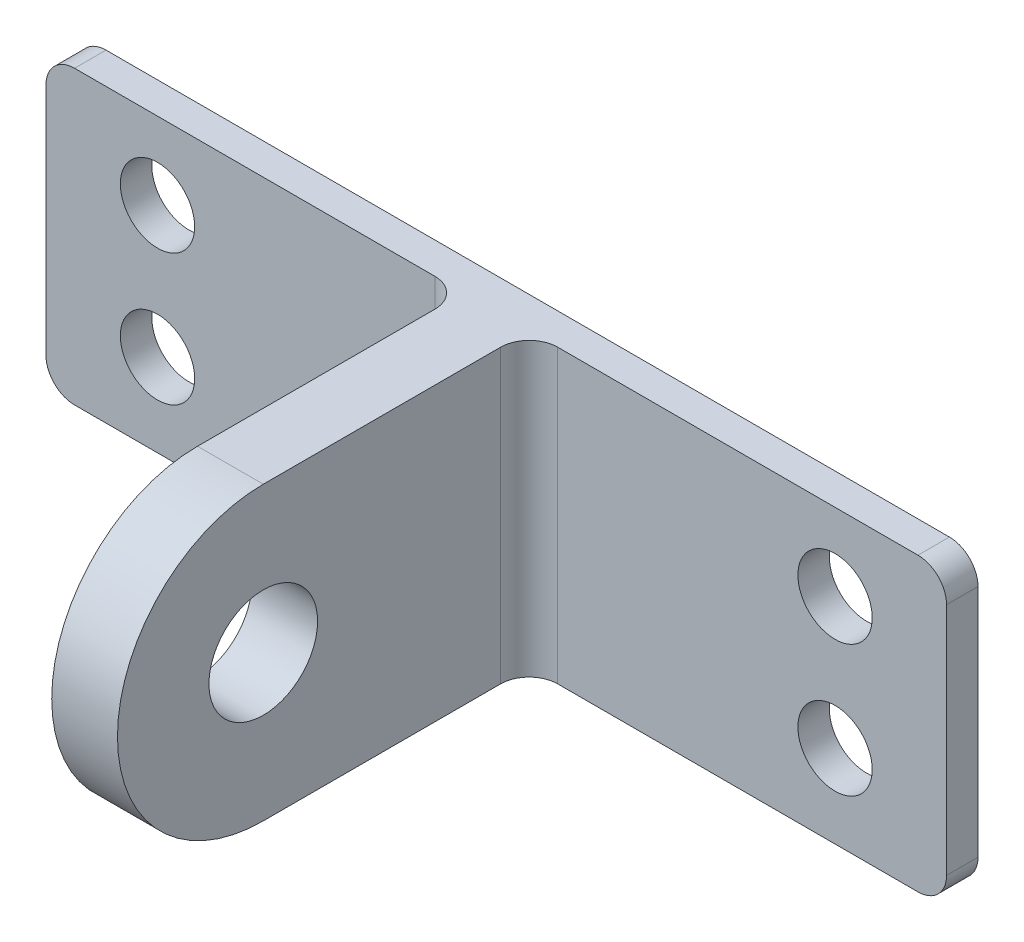
ISO-10303-21;
HEADER;
FILE_DESCRIPTION(('STEP AP214'),'2;1');
FILE_NAME('part.step','',(''),(''),'','','');
FILE_SCHEMA(('AUTOMOTIVE_DESIGN { 1 0 10303 214 1 1 1 1 }'));
ENDSEC;
DATA;
#1=APPLICATION_CONTEXT('core data for automotive mechanical design processes');
#2=APPLICATION_PROTOCOL_DEFINITION('international standard','automotive_design',2000,#1);
#3=PRODUCT_CONTEXT('',#1,'mechanical');
#4=PRODUCT('Part','Part','',(#3));
#5=PRODUCT_RELATED_PRODUCT_CATEGORY('part','',(#4));
#6=PRODUCT_DEFINITION_FORMATION('','',#4);
#7=PRODUCT_DEFINITION_CONTEXT('part definition',#1,'design');
#8=PRODUCT_DEFINITION('design','',#6,#7);
#9=PRODUCT_DEFINITION_SHAPE('','',#8);
#10=(LENGTH_UNIT() NAMED_UNIT(*) SI_UNIT(.MILLI.,.METRE.));
#11=(NAMED_UNIT(*) PLANE_ANGLE_UNIT() SI_UNIT($,.RADIAN.));
#12=(NAMED_UNIT(*) SI_UNIT($,.STERADIAN.) SOLID_ANGLE_UNIT());
#13=UNCERTAINTY_MEASURE_WITH_UNIT(LENGTH_MEASURE(1.E-05),#10,'distance_accuracy_value','');
#14=(GEOMETRIC_REPRESENTATION_CONTEXT(3) GLOBAL_UNCERTAINTY_ASSIGNED_CONTEXT((#13)) GLOBAL_UNIT_ASSIGNED_CONTEXT((#10,
#11,#12)) REPRESENTATION_CONTEXT('',''));
#15=CARTESIAN_POINT('',(0.,0.,0.));
#16=DIRECTION('',(0.,0.,1.));
#17=DIRECTION('',(1.,0.,0.));
#18=AXIS2_PLACEMENT_3D('',#15,#16,#17);
#19=CARTESIAN_POINT('',(0.,0.571428571428572,2.794));
#20=DIRECTION('',(0.,1.,0.));
#21=DIRECTION('',(0.,0.,1.));
#22=AXIS2_PLACEMENT_3D('',#19,#20,#21);
#23=PLANE('',#22);
#24=DIRECTION('',(0.,0.,-1.));
#25=VECTOR('',#24,1.);
#26=CARTESIAN_POINT('',(36.135948051948,0.571428571428572,39.624));
#27=LINE('',#26,#25);
#28=CARTESIAN_POINT('',(36.135948051948,0.571428571428572,26.416));
#29=VERTEX_POINT('',#28);
#30=CARTESIAN_POINT('',(36.135948051948,0.571428571428572,5.334));
#31=VERTEX_POINT('',#30);
#32=EDGE_CURVE('E147',#29,#31,#27,.T.);
#33=ORIENTED_EDGE('',*,*,#32,.F.);
#34=DIRECTION('',(1.,0.,0.));
#35=VECTOR('',#34,1.);
#36=CARTESIAN_POINT('',(2.35394805194805,0.571428571428572,26.416));
#37=LINE('',#36,#35);
#38=CARTESIAN_POINT('',(41.9779480519481,0.571428571428572,26.416));
#39=VERTEX_POINT('',#38);
#40=EDGE_CURVE('E137',#29,#39,#37,.T.);
#41=ORIENTED_EDGE('',*,*,#40,.T.);
#42=DIRECTION('',(0.,0.,-1.));
#43=VECTOR('',#42,1.);
#44=CARTESIAN_POINT('',(41.9779480519481,0.571428571428572,39.624));
#45=LINE('',#44,#43);
#46=CARTESIAN_POINT('',(41.9779480519481,0.571428571428572,5.334));
#47=VERTEX_POINT('',#46);
#48=EDGE_CURVE('E144',#39,#47,#45,.T.);
#49=ORIENTED_EDGE('',*,*,#48,.T.);
#50=CARTESIAN_POINT('',(44.5179480519481,0.571428571428572,5.334));
#51=DIRECTION('',(0.,1.,0.));
#52=DIRECTION('',(0.,0.,1.));
#53=AXIS2_PLACEMENT_3D('',#50,#51,#52);
#54=CIRCLE('',#53,2.54);
#55=CARTESIAN_POINT('',(44.5179480519481,0.571428571428572,2.794));
#56=VERTEX_POINT('',#55);
#57=EDGE_CURVE('E11',#47,#56,#54,.F.);
#58=ORIENTED_EDGE('',*,*,#57,.T.);
#59=DIRECTION('',(1.,0.,0.));
#60=VECTOR('',#59,1.);
#61=CARTESIAN_POINT('',(0.,0.571428571428572,2.794));
#62=LINE('',#61,#60);
#63=CARTESIAN_POINT('',(76.521948051948,0.571428571428572,2.794));
#64=VERTEX_POINT('',#63);
#65=EDGE_CURVE('E284',#56,#64,#62,.T.);
#66=ORIENTED_EDGE('',*,*,#65,.T.);
#67=DIRECTION('',(0.,0.,-1.));
#68=VECTOR('',#67,1.);
#69=CARTESIAN_POINT('',(76.521948051948,0.571428571428572,0.));
#70=LINE('',#69,#68);
#71=CARTESIAN_POINT('',(76.521948051948,0.571428571428572,0.));
#72=VERTEX_POINT('',#71);
#73=EDGE_CURVE('E187',#64,#72,#70,.T.);
#74=ORIENTED_EDGE('',*,*,#73,.T.);
#75=DIRECTION('',(1.,0.,0.));
#76=VECTOR('',#75,1.);
#77=CARTESIAN_POINT('',(0.,0.571428571428572,0.));
#78=LINE('',#77,#76);
#79=CARTESIAN_POINT('',(1.59194805194805,0.571428571428572,0.));
#80=VERTEX_POINT('',#79);
#81=EDGE_CURVE('E150',#80,#72,#78,.T.);
#82=ORIENTED_EDGE('',*,*,#81,.F.);
#83=DIRECTION('',(0.,0.,-1.));
#84=VECTOR('',#83,1.);
#85=CARTESIAN_POINT('',(1.59194805194805,0.571428571428572,2.794));
#86=LINE('',#85,#84);
#87=CARTESIAN_POINT('',(1.59194805194805,0.571428571428572,2.794));
#88=VERTEX_POINT('',#87);
#89=EDGE_CURVE('E174',#80,#88,#86,.F.);
#90=ORIENTED_EDGE('',*,*,#89,.T.);
#91=DIRECTION('',(1.,0.,0.));
#92=VECTOR('',#91,1.);
#93=CARTESIAN_POINT('',(0.,0.571428571428572,2.794));
#94=LINE('',#93,#92);
#95=CARTESIAN_POINT('',(33.595948051948,0.571428571428572,2.794));
#96=VERTEX_POINT('',#95);
#97=EDGE_CURVE('E159',#88,#96,#94,.T.);
#98=ORIENTED_EDGE('',*,*,#97,.T.);
#99=CARTESIAN_POINT('',(33.595948051948,0.571428571428572,5.334));
#100=DIRECTION('',(0.,1.,0.));
#101=DIRECTION('',(0.,0.,1.));
#102=AXIS2_PLACEMENT_3D('',#99,#100,#101);
#103=CIRCLE('',#102,2.54);
#104=EDGE_CURVE('E234',#96,#31,#103,.F.);
#105=ORIENTED_EDGE('',*,*,#104,.T.);
#106=EDGE_LOOP('',(#33,#41,#49,#58,#66,#74,#82,#90,#98,#105));
#107=FACE_BOUND('',#106,.T.);
#108=ADVANCED_FACE('F34',(#107),#23,.T.);
#109=CARTESIAN_POINT('',(0.,-25.3365714285714,2.794));
#110=DIRECTION('',(0.,1.,0.));
#111=DIRECTION('',(0.,0.,1.));
#112=AXIS2_PLACEMENT_3D('',#109,#110,#111);
#113=PLANE('',#112);
#114=DIRECTION('',(1.,0.,0.));
#115=VECTOR('',#114,1.);
#116=CARTESIAN_POINT('',(2.35394805194805,-25.3365714285714,26.416));
#117=LINE('',#116,#115);
#118=CARTESIAN_POINT('',(36.135948051948,-25.3365714285714,26.416));
#119=VERTEX_POINT('',#118);
#120=CARTESIAN_POINT('',(41.9779480519481,-25.3365714285714,26.416));
#121=VERTEX_POINT('',#120);
#122=EDGE_CURVE('E140',#119,#121,#117,.T.);
#123=ORIENTED_EDGE('',*,*,#122,.F.);
#124=DIRECTION('',(0.,0.,-1.));
#125=VECTOR('',#124,1.);
#126=CARTESIAN_POINT('',(36.135948051948,-25.3365714285714,39.624));
#127=LINE('',#126,#125);
#128=CARTESIAN_POINT('',(36.135948051948,-25.3365714285714,5.334));
#129=VERTEX_POINT('',#128);
#130=EDGE_CURVE('E155',#119,#129,#127,.T.);
#131=ORIENTED_EDGE('',*,*,#130,.T.);
#132=CARTESIAN_POINT('',(33.595948051948,-25.3365714285714,5.334));
#133=DIRECTION('',(0.,1.,0.));
#134=DIRECTION('',(0.,0.,1.));
#135=AXIS2_PLACEMENT_3D('',#132,#133,#134);
#136=CIRCLE('',#135,2.54);
#137=CARTESIAN_POINT('',(33.595948051948,-25.3365714285714,2.794));
#138=VERTEX_POINT('',#137);
#139=EDGE_CURVE('E232',#129,#138,#136,.T.);
#140=ORIENTED_EDGE('',*,*,#139,.T.);
#141=DIRECTION('',(1.,0.,0.));
#142=VECTOR('',#141,1.);
#143=CARTESIAN_POINT('',(0.,-25.3365714285714,2.794));
#144=LINE('',#143,#142);
#145=CARTESIAN_POINT('',(1.59194805194805,-25.3365714285714,2.794));
#146=VERTEX_POINT('',#145);
#147=EDGE_CURVE('E166',#146,#138,#144,.T.);
#148=ORIENTED_EDGE('',*,*,#147,.F.);
#149=DIRECTION('',(0.,0.,-1.));
#150=VECTOR('',#149,1.);
#151=CARTESIAN_POINT('',(1.59194805194805,-25.3365714285714,0.));
#152=LINE('',#151,#150);
#153=CARTESIAN_POINT('',(1.59194805194805,-25.3365714285714,0.));
#154=VERTEX_POINT('',#153);
#155=EDGE_CURVE('E208',#146,#154,#152,.T.);
#156=ORIENTED_EDGE('',*,*,#155,.T.);
#157=DIRECTION('',(1.,0.,0.));
#158=VECTOR('',#157,1.);
#159=CARTESIAN_POINT('',(0.,-25.3365714285714,0.));
#160=LINE('',#159,#158);
#161=CARTESIAN_POINT('',(76.521948051948,-25.3365714285714,0.));
#162=VERTEX_POINT('',#161);
#163=EDGE_CURVE('E178',#154,#162,#160,.T.);
#164=ORIENTED_EDGE('',*,*,#163,.T.);
#165=DIRECTION('',(0.,0.,-1.));
#166=VECTOR('',#165,1.);
#167=CARTESIAN_POINT('',(76.521948051948,-25.3365714285714,2.794));
#168=LINE('',#167,#166);
#169=CARTESIAN_POINT('',(76.521948051948,-25.3365714285714,2.794));
#170=VERTEX_POINT('',#169);
#171=EDGE_CURVE('E211',#162,#170,#168,.F.);
#172=ORIENTED_EDGE('',*,*,#171,.T.);
#173=DIRECTION('',(1.,0.,0.));
#174=VECTOR('',#173,1.);
#175=CARTESIAN_POINT('',(0.,-25.3365714285714,2.794));
#176=LINE('',#175,#174);
#177=CARTESIAN_POINT('',(44.5179480519481,-25.3365714285714,2.794));
#178=VERTEX_POINT('',#177);
#179=EDGE_CURVE('E279',#178,#170,#176,.T.);
#180=ORIENTED_EDGE('',*,*,#179,.F.);
#181=CARTESIAN_POINT('',(44.5179480519481,-25.3365714285714,5.334));
#182=DIRECTION('',(0.,1.,0.));
#183=DIRECTION('',(0.,0.,1.));
#184=AXIS2_PLACEMENT_3D('',#181,#182,#183);
#185=CIRCLE('',#184,2.54);
#186=CARTESIAN_POINT('',(41.9779480519481,-25.3365714285714,5.334));
#187=VERTEX_POINT('',#186);
#188=EDGE_CURVE('E42',#178,#187,#185,.T.);
#189=ORIENTED_EDGE('',*,*,#188,.T.);
#190=DIRECTION('',(0.,0.,-1.));
#191=VECTOR('',#190,1.);
#192=CARTESIAN_POINT('',(41.9779480519481,-25.3365714285714,39.624));
#193=LINE('',#192,#191);
#194=EDGE_CURVE('E282',#121,#187,#193,.T.);
#195=ORIENTED_EDGE('',*,*,#194,.F.);
#196=EDGE_LOOP('',(#123,#131,#140,#148,#156,#164,#172,#180,#189,#195));
#197=FACE_BOUND('',#196,.T.);
#198=ADVANCED_FACE('F247',(#197),#113,.F.);
#199=CARTESIAN_POINT('',(36.135948051948,0.,39.624));
#200=DIRECTION('',(1.,0.,0.));
#201=DIRECTION('',(0.,0.,-1.));
#202=AXIS2_PLACEMENT_3D('',#199,#200,#201);
#203=PLANE('',#202);
#204=CARTESIAN_POINT('',(36.135948051948,-12.3825714285714,26.416));
#205=DIRECTION('',(1.,0.,0.));
#206=DIRECTION('',(0.,0.,-1.));
#207=AXIS2_PLACEMENT_3D('',#204,#205,#206);
#208=CIRCLE('',#207,4.826);
#209=CARTESIAN_POINT('',(36.135948051948,-12.3825714285714,21.59));
#210=VERTEX_POINT('',#209);
#211=EDGE_CURVE('E291',#210,#210,#208,.T.);
#212=ORIENTED_EDGE('',*,*,#211,.T.);
#213=EDGE_LOOP('',(#212));
#214=FACE_BOUND('',#213,.T.);
#215=ORIENTED_EDGE('',*,*,#32,.T.);
#216=DIRECTION('',(0.,-1.,0.));
#217=VECTOR('',#216,1.);
#218=CARTESIAN_POINT('',(36.135948051948,0.,5.334));
#219=LINE('',#218,#217);
#220=EDGE_CURVE('E223',#31,#129,#219,.T.);
#221=ORIENTED_EDGE('',*,*,#220,.T.);
#222=ORIENTED_EDGE('',*,*,#130,.F.);
#223=CARTESIAN_POINT('',(36.135948051948,-12.3825714285714,26.416));
#224=DIRECTION('',(1.,0.,0.));
#225=DIRECTION('',(0.,0.,-1.));
#226=AXIS2_PLACEMENT_3D('',#223,#224,#225);
#227=CIRCLE('',#226,12.954);
#228=EDGE_CURVE('E244',#29,#119,#227,.T.);
#229=ORIENTED_EDGE('',*,*,#228,.F.);
#230=EDGE_LOOP('',(#215,#221,#222,#229));
#231=FACE_BOUND('',#230,.T.);
#232=ADVANCED_FACE('F241',(#214,#231),#203,.F.);
#233=CARTESIAN_POINT('',(41.9779480519481,0.,39.624));
#234=DIRECTION('',(1.,0.,0.));
#235=DIRECTION('',(0.,0.,-1.));
#236=AXIS2_PLACEMENT_3D('',#233,#234,#235);
#237=PLANE('',#236);
#238=CARTESIAN_POINT('',(41.9779480519481,-12.3825714285714,26.416));
#239=DIRECTION('',(1.,0.,0.));
#240=DIRECTION('',(0.,0.,-1.));
#241=AXIS2_PLACEMENT_3D('',#238,#239,#240);
#242=CIRCLE('',#241,4.826);
#243=CARTESIAN_POINT('',(41.9779480519481,-12.3825714285714,21.59));
#244=VERTEX_POINT('',#243);
#245=EDGE_CURVE('E308',#244,#244,#242,.T.);
#246=ORIENTED_EDGE('',*,*,#245,.F.);
#247=EDGE_LOOP('',(#246));
#248=FACE_BOUND('',#247,.T.);
#249=ORIENTED_EDGE('',*,*,#194,.T.);
#250=DIRECTION('',(0.,-1.,0.));
#251=VECTOR('',#250,1.);
#252=CARTESIAN_POINT('',(41.9779480519481,0.571428571428572,5.334));
#253=LINE('',#252,#251);
#254=EDGE_CURVE('E55',#187,#47,#253,.F.);
#255=ORIENTED_EDGE('',*,*,#254,.T.);
#256=ORIENTED_EDGE('',*,*,#48,.F.);
#257=CARTESIAN_POINT('',(41.9779480519481,-12.3825714285714,26.416));
#258=DIRECTION('',(1.,0.,0.));
#259=DIRECTION('',(0.,0.,-1.));
#260=AXIS2_PLACEMENT_3D('',#257,#258,#259);
#261=CIRCLE('',#260,12.954);
#262=EDGE_CURVE('E134',#39,#121,#261,.T.);
#263=ORIENTED_EDGE('',*,*,#262,.T.);
#264=EDGE_LOOP('',(#249,#255,#256,#263));
#265=FACE_BOUND('',#264,.T.);
#266=ADVANCED_FACE('F149',(#248,#265),#237,.T.);
#267=CARTESIAN_POINT('',(-0.948051948051948,0.,2.794));
#268=DIRECTION('',(-1.,0.,0.));
#269=DIRECTION('',(0.,-1.,0.));
#270=AXIS2_PLACEMENT_3D('',#267,#268,#269);
#271=PLANE('',#270);
#272=DIRECTION('',(0.,1.,0.));
#273=VECTOR('',#272,1.);
#274=CARTESIAN_POINT('',(-0.948051948051948,0.,0.));
#275=LINE('',#274,#273);
#276=CARTESIAN_POINT('',(-0.948051948051945,-22.7965714285714,0.));
#277=VERTEX_POINT('',#276);
#278=CARTESIAN_POINT('',(-0.948051948051947,-1.96857142857143,0.));
#279=VERTEX_POINT('',#278);
#280=EDGE_CURVE('E153',#277,#279,#275,.T.);
#281=ORIENTED_EDGE('',*,*,#280,.F.);
#282=DIRECTION('',(0.,0.,-1.));
#283=VECTOR('',#282,1.);
#284=CARTESIAN_POINT('',(-0.948051948051945,-22.7965714285714,2.794));
#285=LINE('',#284,#283);
#286=CARTESIAN_POINT('',(-0.948051948051945,-22.7965714285714,2.794));
#287=VERTEX_POINT('',#286);
#288=EDGE_CURVE('E217',#277,#287,#285,.F.);
#289=ORIENTED_EDGE('',*,*,#288,.T.);
#290=DIRECTION('',(0.,1.,0.));
#291=VECTOR('',#290,1.);
#292=CARTESIAN_POINT('',(-0.948051948051948,0.,2.794));
#293=LINE('',#292,#291);
#294=CARTESIAN_POINT('',(-0.948051948051947,-1.96857142857143,2.794));
#295=VERTEX_POINT('',#294);
#296=EDGE_CURVE('E162',#287,#295,#293,.T.);
#297=ORIENTED_EDGE('',*,*,#296,.T.);
#298=DIRECTION('',(0.,0.,-1.));
#299=VECTOR('',#298,1.);
#300=CARTESIAN_POINT('',(-0.948051948051947,-1.96857142857143,2.794));
#301=LINE('',#300,#299);
#302=EDGE_CURVE('E214',#295,#279,#301,.T.);
#303=ORIENTED_EDGE('',*,*,#302,.T.);
#304=EDGE_LOOP('',(#281,#289,#297,#303));
#305=FACE_BOUND('',#304,.T.);
#306=ADVANCED_FACE('F318',(#305),#271,.T.);
#307=CARTESIAN_POINT('',(8.95794805194805,-6.28657142857143,2.794));
#308=DIRECTION('',(0.,0.,-1.));
#309=DIRECTION('',(-1.,0.,0.));
#310=AXIS2_PLACEMENT_3D('',#307,#308,#309);
#311=CYLINDRICAL_SURFACE('',#310,3.302);
#312=CARTESIAN_POINT('',(8.95794805194805,-6.28657142857143,2.794));
#313=DIRECTION('',(0.,0.,1.));
#314=DIRECTION('',(1.,0.,0.));
#315=AXIS2_PLACEMENT_3D('',#312,#313,#314);
#316=CIRCLE('',#315,3.302);
#317=CARTESIAN_POINT('',(12.2599480519481,-6.28657142857143,2.794));
#318=VERTEX_POINT('',#317);
#319=EDGE_CURVE('E169',#318,#318,#316,.T.);
#320=ORIENTED_EDGE('',*,*,#319,.T.);
#321=EDGE_LOOP('',(#320));
#322=FACE_BOUND('',#321,.T.);
#323=CARTESIAN_POINT('',(8.95794805194805,-6.28657142857143,0.));
#324=DIRECTION('',(0.,0.,1.));
#325=DIRECTION('',(1.,0.,0.));
#326=AXIS2_PLACEMENT_3D('',#323,#324,#325);
#327=CIRCLE('',#326,3.302);
#328=CARTESIAN_POINT('',(12.2599480519481,-6.28657142857143,0.));
#329=VERTEX_POINT('',#328);
#330=EDGE_CURVE('E181',#329,#329,#327,.T.);
#331=ORIENTED_EDGE('',*,*,#330,.F.);
#332=EDGE_LOOP('',(#331));
#333=FACE_BOUND('',#332,.T.);
#334=ADVANCED_FACE('F324',(#322,#333),#311,.F.);
#335=CARTESIAN_POINT('',(8.95794805194805,-17.9705714285714,2.794));
#336=DIRECTION('',(0.,0.,-1.));
#337=DIRECTION('',(-1.,0.,0.));
#338=AXIS2_PLACEMENT_3D('',#335,#336,#337);
#339=CYLINDRICAL_SURFACE('',#338,3.302);
#340=CARTESIAN_POINT('',(8.95794805194805,-17.9705714285714,2.794));
#341=DIRECTION('',(0.,0.,1.));
#342=DIRECTION('',(1.,0.,0.));
#343=AXIS2_PLACEMENT_3D('',#340,#341,#342);
#344=CIRCLE('',#343,3.302);
#345=CARTESIAN_POINT('',(12.2599480519481,-17.9705714285714,2.794));
#346=VERTEX_POINT('',#345);
#347=EDGE_CURVE('E172',#346,#346,#344,.F.);
#348=ORIENTED_EDGE('',*,*,#347,.F.);
#349=EDGE_LOOP('',(#348));
#350=FACE_BOUND('',#349,.T.);
#351=CARTESIAN_POINT('',(8.95794805194805,-17.9705714285714,0.));
#352=DIRECTION('',(0.,0.,1.));
#353=DIRECTION('',(1.,0.,0.));
#354=AXIS2_PLACEMENT_3D('',#351,#352,#353);
#355=CIRCLE('',#354,3.302);
#356=CARTESIAN_POINT('',(12.2599480519481,-17.9705714285714,0.));
#357=VERTEX_POINT('',#356);
#358=EDGE_CURVE('E163',#357,#357,#355,.F.);
#359=ORIENTED_EDGE('',*,*,#358,.T.);
#360=EDGE_LOOP('',(#359));
#361=FACE_BOUND('',#360,.T.);
#362=ADVANCED_FACE('F385',(#350,#361),#339,.F.);
#363=CARTESIAN_POINT('',(0.,0.,2.794));
#364=DIRECTION('',(0.,0.,1.));
#365=DIRECTION('',(1.,0.,0.));
#366=AXIS2_PLACEMENT_3D('',#363,#364,#365);
#367=PLANE('',#366);
#368=ORIENTED_EDGE('',*,*,#147,.T.);
#369=DIRECTION('',(0.,-1.,0.));
#370=VECTOR('',#369,1.);
#371=CARTESIAN_POINT('',(33.595948051948,0.,2.794));
#372=LINE('',#371,#370);
#373=EDGE_CURVE('E226',#138,#96,#372,.F.);
#374=ORIENTED_EDGE('',*,*,#373,.T.);
#375=ORIENTED_EDGE('',*,*,#97,.F.);
#376=CARTESIAN_POINT('',(1.59194805194805,-1.96857142857143,2.794));
#377=DIRECTION('',(0.,0.,1.));
#378=DIRECTION('',(1.,0.,0.));
#379=AXIS2_PLACEMENT_3D('',#376,#377,#378);
#380=CIRCLE('',#379,2.54);
#381=EDGE_CURVE('E219',#88,#295,#380,.T.);
#382=ORIENTED_EDGE('',*,*,#381,.T.);
#383=ORIENTED_EDGE('',*,*,#296,.F.);
#384=CARTESIAN_POINT('',(1.59194805194805,-22.7965714285714,2.794));
#385=DIRECTION('',(0.,0.,1.));
#386=DIRECTION('',(1.,0.,0.));
#387=AXIS2_PLACEMENT_3D('',#384,#385,#386);
#388=CIRCLE('',#387,2.54);
#389=EDGE_CURVE('E221',#287,#146,#388,.T.);
#390=ORIENTED_EDGE('',*,*,#389,.T.);
#391=EDGE_LOOP('',(#368,#374,#375,#382,#383,#390));
#392=FACE_BOUND('',#391,.T.);
#393=ORIENTED_EDGE('',*,*,#319,.F.);
#394=EDGE_LOOP('',(#393));
#395=FACE_BOUND('',#394,.T.);
#396=ORIENTED_EDGE('',*,*,#347,.T.);
#397=EDGE_LOOP('',(#396));
#398=FACE_BOUND('',#397,.T.);
#399=ADVANCED_FACE('F250',(#392,#395,#398),#367,.T.);
#400=CARTESIAN_POINT('',(0.,0.,0.));
#401=DIRECTION('',(0.,0.,1.));
#402=DIRECTION('',(1.,0.,0.));
#403=AXIS2_PLACEMENT_3D('',#400,#401,#402);
#404=PLANE('',#403);
#405=ORIENTED_EDGE('',*,*,#81,.T.);
#406=CARTESIAN_POINT('',(76.521948051948,-1.96857142857143,0.));
#407=DIRECTION('',(0.,0.,1.));
#408=DIRECTION('',(1.,0.,0.));
#409=AXIS2_PLACEMENT_3D('',#406,#407,#408);
#410=CIRCLE('',#409,2.54);
#411=CARTESIAN_POINT('',(79.0619480519481,-1.96857142857143,0.));
#412=VERTEX_POINT('',#411);
#413=EDGE_CURVE('E196',#72,#412,#410,.F.);
#414=ORIENTED_EDGE('',*,*,#413,.T.);
#415=DIRECTION('',(0.,1.,0.));
#416=VECTOR('',#415,1.);
#417=CARTESIAN_POINT('',(79.0619480519481,0.,0.));
#418=LINE('',#417,#416);
#419=CARTESIAN_POINT('',(79.0619480519481,-22.7965714285714,0.));
#420=VERTEX_POINT('',#419);
#421=EDGE_CURVE('E265',#420,#412,#418,.T.);
#422=ORIENTED_EDGE('',*,*,#421,.F.);
#423=CARTESIAN_POINT('',(76.521948051948,-22.7965714285714,0.));
#424=DIRECTION('',(0.,0.,1.));
#425=DIRECTION('',(1.,0.,0.));
#426=AXIS2_PLACEMENT_3D('',#423,#424,#425);
#427=CIRCLE('',#426,2.54);
#428=EDGE_CURVE('E194',#420,#162,#427,.F.);
#429=ORIENTED_EDGE('',*,*,#428,.T.);
#430=ORIENTED_EDGE('',*,*,#163,.F.);
#431=CARTESIAN_POINT('',(1.59194805194805,-22.7965714285714,0.));
#432=DIRECTION('',(0.,0.,1.));
#433=DIRECTION('',(1.,0.,0.));
#434=AXIS2_PLACEMENT_3D('',#431,#432,#433);
#435=CIRCLE('',#434,2.54);
#436=EDGE_CURVE('E192',#154,#277,#435,.F.);
#437=ORIENTED_EDGE('',*,*,#436,.T.);
#438=ORIENTED_EDGE('',*,*,#280,.T.);
#439=CARTESIAN_POINT('',(1.59194805194805,-1.96857142857143,0.));
#440=DIRECTION('',(0.,0.,1.));
#441=DIRECTION('',(1.,0.,0.));
#442=AXIS2_PLACEMENT_3D('',#439,#440,#441);
#443=CIRCLE('',#442,2.54);
#444=EDGE_CURVE('E190',#279,#80,#443,.F.);
#445=ORIENTED_EDGE('',*,*,#444,.T.);
#446=EDGE_LOOP('',(#405,#414,#422,#429,#430,#437,#438,#445));
#447=FACE_BOUND('',#446,.T.);
#448=ORIENTED_EDGE('',*,*,#330,.T.);
#449=EDGE_LOOP('',(#448));
#450=FACE_BOUND('',#449,.T.);
#451=ORIENTED_EDGE('',*,*,#358,.F.);
#452=EDGE_LOOP('',(#451));
#453=FACE_BOUND('',#452,.T.);
#454=CARTESIAN_POINT('',(69.1559480519481,-17.9705714285714,0.));
#455=DIRECTION('',(0.,0.,1.));
#456=DIRECTION('',(1.,0.,0.));
#457=AXIS2_PLACEMENT_3D('',#454,#455,#456);
#458=CIRCLE('',#457,3.302);
#459=CARTESIAN_POINT('',(72.4579480519481,-17.9705714285714,0.));
#460=VERTEX_POINT('',#459);
#461=EDGE_CURVE('E288',#460,#460,#458,.T.);
#462=ORIENTED_EDGE('',*,*,#461,.T.);
#463=EDGE_LOOP('',(#462));
#464=FACE_BOUND('',#463,.T.);
#465=CARTESIAN_POINT('',(69.1559480519481,-6.28657142857143,0.));
#466=DIRECTION('',(0.,0.,1.));
#467=DIRECTION('',(1.,0.,0.));
#468=AXIS2_PLACEMENT_3D('',#465,#466,#467);
#469=CIRCLE('',#468,3.302);
#470=CARTESIAN_POINT('',(72.4579480519481,-6.28657142857143,0.));
#471=VERTEX_POINT('',#470);
#472=EDGE_CURVE('E293',#471,#471,#469,.F.);
#473=ORIENTED_EDGE('',*,*,#472,.F.);
#474=EDGE_LOOP('',(#473));
#475=FACE_BOUND('',#474,.T.);
#476=ADVANCED_FACE('F260',(#447,#450,#453,#464,#475),#404,.F.);
#477=CARTESIAN_POINT('',(79.0619480519481,0.,2.794));
#478=DIRECTION('',(-1.,0.,0.));
#479=DIRECTION('',(0.,0.,1.));
#480=AXIS2_PLACEMENT_3D('',#477,#478,#479);
#481=PLANE('',#480);
#482=ORIENTED_EDGE('',*,*,#421,.T.);
#483=DIRECTION('',(0.,0.,-1.));
#484=VECTOR('',#483,1.);
#485=CARTESIAN_POINT('',(79.0619480519481,-1.96857142857143,2.794));
#486=LINE('',#485,#484);
#487=CARTESIAN_POINT('',(79.0619480519481,-1.96857142857143,2.794));
#488=VERTEX_POINT('',#487);
#489=EDGE_CURVE('E201',#412,#488,#486,.F.);
#490=ORIENTED_EDGE('',*,*,#489,.T.);
#491=DIRECTION('',(0.,1.,0.));
#492=VECTOR('',#491,1.);
#493=CARTESIAN_POINT('',(79.0619480519481,0.,2.794));
#494=LINE('',#493,#492);
#495=CARTESIAN_POINT('',(79.0619480519481,-22.7965714285714,2.794));
#496=VERTEX_POINT('',#495);
#497=EDGE_CURVE('E275',#496,#488,#494,.T.);
#498=ORIENTED_EDGE('',*,*,#497,.F.);
#499=DIRECTION('',(0.,0.,-1.));
#500=VECTOR('',#499,1.);
#501=CARTESIAN_POINT('',(79.0619480519481,-22.7965714285714,2.794));
#502=LINE('',#501,#500);
#503=EDGE_CURVE('E198',#496,#420,#502,.T.);
#504=ORIENTED_EDGE('',*,*,#503,.T.);
#505=EDGE_LOOP('',(#482,#490,#498,#504));
#506=FACE_BOUND('',#505,.T.);
#507=ADVANCED_FACE('F272',(#506),#481,.F.);
#508=CARTESIAN_POINT('',(69.1559480519481,-17.9705714285714,2.794));
#509=DIRECTION('',(0.,0.,-1.));
#510=DIRECTION('',(-1.,0.,0.));
#511=AXIS2_PLACEMENT_3D('',#508,#509,#510);
#512=CYLINDRICAL_SURFACE('',#511,3.302);
#513=CARTESIAN_POINT('',(69.1559480519481,-17.9705714285714,2.794));
#514=DIRECTION('',(0.,0.,1.));
#515=DIRECTION('',(1.,0.,0.));
#516=AXIS2_PLACEMENT_3D('',#513,#514,#515);
#517=CIRCLE('',#516,3.302);
#518=CARTESIAN_POINT('',(72.4579480519481,-17.9705714285714,2.794));
#519=VERTEX_POINT('',#518);
#520=EDGE_CURVE('E296',#519,#519,#517,.T.);
#521=ORIENTED_EDGE('',*,*,#520,.T.);
#522=EDGE_LOOP('',(#521));
#523=FACE_BOUND('',#522,.T.);
#524=ORIENTED_EDGE('',*,*,#461,.F.);
#525=EDGE_LOOP('',(#524));
#526=FACE_BOUND('',#525,.T.);
#527=ADVANCED_FACE('F365',(#523,#526),#512,.F.);
#528=CARTESIAN_POINT('',(69.1559480519481,-6.28657142857143,2.794));
#529=DIRECTION('',(0.,0.,-1.));
#530=DIRECTION('',(-1.,0.,0.));
#531=AXIS2_PLACEMENT_3D('',#528,#529,#530);
#532=CYLINDRICAL_SURFACE('',#531,3.302);
#533=CARTESIAN_POINT('',(69.1559480519481,-6.28657142857143,2.794));
#534=DIRECTION('',(0.,0.,1.));
#535=DIRECTION('',(1.,0.,0.));
#536=AXIS2_PLACEMENT_3D('',#533,#534,#535);
#537=CIRCLE('',#536,3.302);
#538=CARTESIAN_POINT('',(72.4579480519481,-6.28657142857143,2.794));
#539=VERTEX_POINT('',#538);
#540=EDGE_CURVE('E278',#539,#539,#537,.F.);
#541=ORIENTED_EDGE('',*,*,#540,.F.);
#542=EDGE_LOOP('',(#541));
#543=FACE_BOUND('',#542,.T.);
#544=ORIENTED_EDGE('',*,*,#472,.T.);
#545=EDGE_LOOP('',(#544));
#546=FACE_BOUND('',#545,.T.);
#547=ADVANCED_FACE('F361',(#543,#546),#532,.F.);
#548=CARTESIAN_POINT('',(0.,0.,2.794));
#549=DIRECTION('',(0.,0.,1.));
#550=DIRECTION('',(1.,0.,0.));
#551=AXIS2_PLACEMENT_3D('',#548,#549,#550);
#552=PLANE('',#551);
#553=ORIENTED_EDGE('',*,*,#520,.F.);
#554=EDGE_LOOP('',(#553));
#555=FACE_BOUND('',#554,.T.);
#556=ORIENTED_EDGE('',*,*,#65,.F.);
#557=DIRECTION('',(0.,-1.,0.));
#558=VECTOR('',#557,1.);
#559=CARTESIAN_POINT('',(44.5179480519481,-25.3365714285714,2.794));
#560=LINE('',#559,#558);
#561=EDGE_CURVE('E228',#56,#178,#560,.T.);
#562=ORIENTED_EDGE('',*,*,#561,.T.);
#563=ORIENTED_EDGE('',*,*,#179,.T.);
#564=CARTESIAN_POINT('',(76.521948051948,-22.7965714285714,2.794));
#565=DIRECTION('',(0.,0.,1.));
#566=DIRECTION('',(1.,0.,0.));
#567=AXIS2_PLACEMENT_3D('',#564,#565,#566);
#568=CIRCLE('',#567,2.54);
#569=EDGE_CURVE('E203',#170,#496,#568,.T.);
#570=ORIENTED_EDGE('',*,*,#569,.T.);
#571=ORIENTED_EDGE('',*,*,#497,.T.);
#572=CARTESIAN_POINT('',(76.521948051948,-1.96857142857143,2.794));
#573=DIRECTION('',(0.,0.,1.));
#574=DIRECTION('',(1.,0.,0.));
#575=AXIS2_PLACEMENT_3D('',#572,#573,#574);
#576=CIRCLE('',#575,2.54);
#577=EDGE_CURVE('E205',#488,#64,#576,.T.);
#578=ORIENTED_EDGE('',*,*,#577,.T.);
#579=EDGE_LOOP('',(#556,#562,#563,#570,#571,#578));
#580=FACE_BOUND('',#579,.T.);
#581=ORIENTED_EDGE('',*,*,#540,.T.);
#582=EDGE_LOOP('',(#581));
#583=FACE_BOUND('',#582,.T.);
#584=ADVANCED_FACE('F300',(#555,#580,#583),#552,.T.);
#585=CARTESIAN_POINT('',(76.521948051948,-1.96857142857143,2.794));
#586=DIRECTION('',(0.,0.,1.));
#587=DIRECTION('',(1.,0.,0.));
#588=AXIS2_PLACEMENT_3D('',#585,#586,#587);
#589=CYLINDRICAL_SURFACE('',#588,2.54);
#590=ORIENTED_EDGE('',*,*,#577,.F.);
#591=ORIENTED_EDGE('',*,*,#489,.F.);
#592=ORIENTED_EDGE('',*,*,#413,.F.);
#593=ORIENTED_EDGE('',*,*,#73,.F.);
#594=EDGE_LOOP('',(#590,#591,#592,#593));
#595=FACE_BOUND('',#594,.T.);
#596=ADVANCED_FACE('F337',(#595),#589,.T.);
#597=CARTESIAN_POINT('',(76.521948051948,-22.7965714285714,2.794));
#598=DIRECTION('',(0.,0.,-1.));
#599=DIRECTION('',(-1.,0.,0.));
#600=AXIS2_PLACEMENT_3D('',#597,#598,#599);
#601=CYLINDRICAL_SURFACE('',#600,2.54);
#602=ORIENTED_EDGE('',*,*,#569,.F.);
#603=ORIENTED_EDGE('',*,*,#171,.F.);
#604=ORIENTED_EDGE('',*,*,#428,.F.);
#605=ORIENTED_EDGE('',*,*,#503,.F.);
#606=EDGE_LOOP('',(#602,#603,#604,#605));
#607=FACE_BOUND('',#606,.T.);
#608=ADVANCED_FACE('F269',(#607),#601,.T.);
#609=CARTESIAN_POINT('',(1.59194805194805,-22.7965714285714,2.794));
#610=DIRECTION('',(0.,0.,1.));
#611=DIRECTION('',(1.,0.,0.));
#612=AXIS2_PLACEMENT_3D('',#609,#610,#611);
#613=CYLINDRICAL_SURFACE('',#612,2.54);
#614=ORIENTED_EDGE('',*,*,#389,.F.);
#615=ORIENTED_EDGE('',*,*,#288,.F.);
#616=ORIENTED_EDGE('',*,*,#436,.F.);
#617=ORIENTED_EDGE('',*,*,#155,.F.);
#618=EDGE_LOOP('',(#614,#615,#616,#617));
#619=FACE_BOUND('',#618,.T.);
#620=ADVANCED_FACE('F256',(#619),#613,.T.);
#621=CARTESIAN_POINT('',(1.59194805194805,-1.96857142857143,2.794));
#622=DIRECTION('',(0.,0.,-1.));
#623=DIRECTION('',(-1.,0.,0.));
#624=AXIS2_PLACEMENT_3D('',#621,#622,#623);
#625=CYLINDRICAL_SURFACE('',#624,2.54);
#626=ORIENTED_EDGE('',*,*,#381,.F.);
#627=ORIENTED_EDGE('',*,*,#89,.F.);
#628=ORIENTED_EDGE('',*,*,#444,.F.);
#629=ORIENTED_EDGE('',*,*,#302,.F.);
#630=EDGE_LOOP('',(#626,#627,#628,#629));
#631=FACE_BOUND('',#630,.T.);
#632=ADVANCED_FACE('F345',(#631),#625,.T.);
#633=CARTESIAN_POINT('',(2.35394805194805,-12.3825714285714,26.416));
#634=DIRECTION('',(1.,0.,0.));
#635=DIRECTION('',(0.,0.,-1.));
#636=AXIS2_PLACEMENT_3D('',#633,#634,#635);
#637=CYLINDRICAL_SURFACE('',#636,4.826);
#638=ORIENTED_EDGE('',*,*,#245,.T.);
#639=EDGE_LOOP('',(#638));
#640=FACE_BOUND('',#639,.T.);
#641=ORIENTED_EDGE('',*,*,#211,.F.);
#642=EDGE_LOOP('',(#641));
#643=FACE_BOUND('',#642,.T.);
#644=ADVANCED_FACE('F314',(#640,#643),#637,.F.);
#645=CARTESIAN_POINT('',(2.35394805194805,-12.3825714285714,26.416));
#646=DIRECTION('',(1.,0.,0.));
#647=DIRECTION('',(0.,0.,-1.));
#648=AXIS2_PLACEMENT_3D('',#645,#646,#647);
#649=CYLINDRICAL_SURFACE('',#648,12.954);
#650=ORIENTED_EDGE('',*,*,#228,.T.);
#651=ORIENTED_EDGE('',*,*,#122,.T.);
#652=ORIENTED_EDGE('',*,*,#262,.F.);
#653=ORIENTED_EDGE('',*,*,#40,.F.);
#654=EDGE_LOOP('',(#650,#651,#652,#653));
#655=FACE_BOUND('',#654,.T.);
#656=ADVANCED_FACE('F136',(#655),#649,.T.);
#657=CARTESIAN_POINT('',(33.595948051948,0.,5.334));
#658=DIRECTION('',(0.,-1.,0.));
#659=DIRECTION('',(0.,0.,-1.));
#660=AXIS2_PLACEMENT_3D('',#657,#658,#659);
#661=CYLINDRICAL_SURFACE('',#660,2.54);
#662=ORIENTED_EDGE('',*,*,#104,.F.);
#663=ORIENTED_EDGE('',*,*,#373,.F.);
#664=ORIENTED_EDGE('',*,*,#139,.F.);
#665=ORIENTED_EDGE('',*,*,#220,.F.);
#666=EDGE_LOOP('',(#662,#663,#664,#665));
#667=FACE_BOUND('',#666,.T.);
#668=ADVANCED_FACE('F245',(#667),#661,.F.);
#669=CARTESIAN_POINT('',(44.5179480519481,0.,5.334));
#670=DIRECTION('',(0.,1.,0.));
#671=DIRECTION('',(0.,0.,1.));
#672=AXIS2_PLACEMENT_3D('',#669,#670,#671);
#673=CYLINDRICAL_SURFACE('',#672,2.54);
#674=ORIENTED_EDGE('',*,*,#57,.F.);
#675=ORIENTED_EDGE('',*,*,#254,.F.);
#676=ORIENTED_EDGE('',*,*,#188,.F.);
#677=ORIENTED_EDGE('',*,*,#561,.F.);
#678=EDGE_LOOP('',(#674,#675,#676,#677));
#679=FACE_BOUND('',#678,.T.);
#680=ADVANCED_FACE('F36',(#679),#673,.F.);
#681=CLOSED_SHELL('',(#108,#198,#232,#266,#306,#334,#362,#399,#476,#507,#527,#547,#584,#596,
#608,#620,#632,#644,#656,#668,#680));
#682=MANIFOLD_SOLID_BREP('B2',#681);
#683=ADVANCED_BREP_SHAPE_REPRESENTATION('',(#18,#682),#14);
#684=SHAPE_DEFINITION_REPRESENTATION(#9,#683);
ENDSEC;
END-ISO-10303-21;
